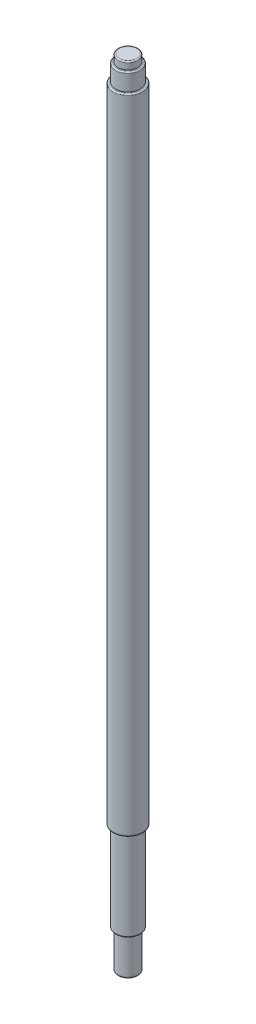
ISO-10303-21;
HEADER;
FILE_DESCRIPTION(('STEP AP214'),'2;1');
FILE_NAME('part.step','',(''),(''),'','','');
FILE_SCHEMA(('AUTOMOTIVE_DESIGN { 1 0 10303 214 1 1 1 1 }'));
ENDSEC;
DATA;
#1=APPLICATION_CONTEXT('core data for automotive mechanical design processes');
#2=APPLICATION_PROTOCOL_DEFINITION('international standard','automotive_design',2000,#1);
#3=PRODUCT_CONTEXT('',#1,'mechanical');
#4=PRODUCT('Part','Part','',(#3));
#5=PRODUCT_RELATED_PRODUCT_CATEGORY('part','',(#4));
#6=PRODUCT_DEFINITION_FORMATION('','',#4);
#7=PRODUCT_DEFINITION_CONTEXT('part definition',#1,'design');
#8=PRODUCT_DEFINITION('design','',#6,#7);
#9=PRODUCT_DEFINITION_SHAPE('','',#8);
#10=(LENGTH_UNIT() NAMED_UNIT(*) SI_UNIT(.MILLI.,.METRE.));
#11=(NAMED_UNIT(*) PLANE_ANGLE_UNIT() SI_UNIT($,.RADIAN.));
#12=(NAMED_UNIT(*) SI_UNIT($,.STERADIAN.) SOLID_ANGLE_UNIT());
#13=UNCERTAINTY_MEASURE_WITH_UNIT(LENGTH_MEASURE(1.E-05),#10,'distance_accuracy_value','');
#14=(GEOMETRIC_REPRESENTATION_CONTEXT(3) GLOBAL_UNCERTAINTY_ASSIGNED_CONTEXT((#13)) GLOBAL_UNIT_ASSIGNED_CONTEXT((#10,
#11,#12)) REPRESENTATION_CONTEXT('',''));
#15=CARTESIAN_POINT('',(0.,0.,0.));
#16=DIRECTION('',(0.,0.,1.));
#17=DIRECTION('',(1.,0.,0.));
#18=AXIS2_PLACEMENT_3D('',#15,#16,#17);
#19=CARTESIAN_POINT('',(0.,0.5,0.));
#20=DIRECTION('',(0.,1.,0.));
#21=DIRECTION('',(0.,0.,1.));
#22=AXIS2_PLACEMENT_3D('',#19,#20,#21);
#23=TOROIDAL_SURFACE('',#22,3.5,0.5);
#24=CARTESIAN_POINT('',(0.,0.5,0.));
#25=DIRECTION('',(0.,1.,0.));
#26=DIRECTION('',(0.,0.,1.));
#27=AXIS2_PLACEMENT_3D('',#24,#25,#26);
#28=CIRCLE('',#27,4.);
#29=CARTESIAN_POINT('',(0.,0.5,4.));
#30=VERTEX_POINT('',#29);
#31=EDGE_CURVE('E43',#30,#30,#28,.T.);
#32=ORIENTED_EDGE('',*,*,#31,.F.);
#33=EDGE_LOOP('',(#32));
#34=FACE_BOUND('',#33,.T.);
#35=CARTESIAN_POINT('',(0.,0.,0.));
#36=DIRECTION('',(0.,1.,0.));
#37=DIRECTION('',(0.,0.,1.));
#38=AXIS2_PLACEMENT_3D('',#35,#36,#37);
#39=CIRCLE('',#38,3.5);
#40=CARTESIAN_POINT('',(0.,0.,3.5));
#41=VERTEX_POINT('',#40);
#42=EDGE_CURVE('E10',#41,#41,#39,.F.);
#43=ORIENTED_EDGE('',*,*,#42,.F.);
#44=EDGE_LOOP('',(#43));
#45=FACE_BOUND('',#44,.T.);
#46=ADVANCED_FACE('F37',(#34,#45),#23,.T.);
#47=CARTESIAN_POINT('',(0.,15.5,0.));
#48=DIRECTION('',(0.,1.,0.));
#49=DIRECTION('',(0.,0.,1.));
#50=AXIS2_PLACEMENT_3D('',#47,#48,#49);
#51=TOROIDAL_SURFACE('',#50,4.5,0.5);
#52=CARTESIAN_POINT('',(0.,15.5,0.));
#53=DIRECTION('',(0.,1.,0.));
#54=DIRECTION('',(0.,0.,1.));
#55=AXIS2_PLACEMENT_3D('',#52,#53,#54);
#56=CIRCLE('',#55,5.);
#57=CARTESIAN_POINT('',(0.,15.5,5.));
#58=VERTEX_POINT('',#57);
#59=EDGE_CURVE('E51',#58,#58,#56,.T.);
#60=ORIENTED_EDGE('',*,*,#59,.F.);
#61=EDGE_LOOP('',(#60));
#62=FACE_BOUND('',#61,.T.);
#63=CARTESIAN_POINT('',(0.,15.,0.));
#64=DIRECTION('',(0.,1.,0.));
#65=DIRECTION('',(0.,0.,1.));
#66=AXIS2_PLACEMENT_3D('',#63,#64,#65);
#67=CIRCLE('',#66,4.5);
#68=CARTESIAN_POINT('',(0.,15.,4.5));
#69=VERTEX_POINT('',#68);
#70=EDGE_CURVE('E47',#69,#69,#67,.F.);
#71=ORIENTED_EDGE('',*,*,#70,.F.);
#72=EDGE_LOOP('',(#71));
#73=FACE_BOUND('',#72,.T.);
#74=ADVANCED_FACE('F111',(#62,#73),#51,.T.);
#75=CARTESIAN_POINT('',(0.,51.5,0.));
#76=DIRECTION('',(0.,1.,0.));
#77=DIRECTION('',(0.,0.,1.));
#78=AXIS2_PLACEMENT_3D('',#75,#76,#77);
#79=TOROIDAL_SURFACE('',#78,5.5,0.5);
#80=CARTESIAN_POINT('',(0.,51.5,0.));
#81=DIRECTION('',(0.,1.,0.));
#82=DIRECTION('',(0.,0.,1.));
#83=AXIS2_PLACEMENT_3D('',#80,#81,#82);
#84=CIRCLE('',#83,6.);
#85=CARTESIAN_POINT('',(0.,51.5,6.));
#86=VERTEX_POINT('',#85);
#87=EDGE_CURVE('E59',#86,#86,#84,.T.);
#88=ORIENTED_EDGE('',*,*,#87,.F.);
#89=EDGE_LOOP('',(#88));
#90=FACE_BOUND('',#89,.T.);
#91=CARTESIAN_POINT('',(0.,51.,0.));
#92=DIRECTION('',(0.,1.,0.));
#93=DIRECTION('',(0.,0.,1.));
#94=AXIS2_PLACEMENT_3D('',#91,#92,#93);
#95=CIRCLE('',#94,5.5);
#96=CARTESIAN_POINT('',(0.,51.,5.5));
#97=VERTEX_POINT('',#96);
#98=EDGE_CURVE('E56',#97,#97,#95,.F.);
#99=ORIENTED_EDGE('',*,*,#98,.F.);
#100=EDGE_LOOP('',(#99));
#101=FACE_BOUND('',#100,.T.);
#102=ADVANCED_FACE('F116',(#90,#101),#79,.T.);
#103=CARTESIAN_POINT('',(0.,310.5,0.));
#104=DIRECTION('',(0.,1.,0.));
#105=DIRECTION('',(0.,0.,1.));
#106=AXIS2_PLACEMENT_3D('',#103,#104,#105);
#107=TOROIDAL_SURFACE('',#106,5.5,0.5);
#108=CARTESIAN_POINT('',(0.,310.5,0.));
#109=DIRECTION('',(0.,1.,0.));
#110=DIRECTION('',(0.,0.,1.));
#111=AXIS2_PLACEMENT_3D('',#108,#109,#110);
#112=CIRCLE('',#111,6.);
#113=CARTESIAN_POINT('',(0.,310.5,6.));
#114=VERTEX_POINT('',#113);
#115=EDGE_CURVE('E65',#114,#114,#112,.F.);
#116=ORIENTED_EDGE('',*,*,#115,.F.);
#117=EDGE_LOOP('',(#116));
#118=FACE_BOUND('',#117,.T.);
#119=CARTESIAN_POINT('',(0.,311.,0.));
#120=DIRECTION('',(0.,1.,0.));
#121=DIRECTION('',(0.,0.,1.));
#122=AXIS2_PLACEMENT_3D('',#119,#120,#121);
#123=CIRCLE('',#122,5.5);
#124=CARTESIAN_POINT('',(0.,311.,5.5));
#125=VERTEX_POINT('',#124);
#126=EDGE_CURVE('E62',#125,#125,#123,.T.);
#127=ORIENTED_EDGE('',*,*,#126,.F.);
#128=EDGE_LOOP('',(#127));
#129=FACE_BOUND('',#128,.T.);
#130=ADVANCED_FACE('F122',(#118,#129),#107,.T.);
#131=CARTESIAN_POINT('',(0.,317.5,0.));
#132=DIRECTION('',(0.,1.,0.));
#133=DIRECTION('',(0.,0.,1.));
#134=AXIS2_PLACEMENT_3D('',#131,#132,#133);
#135=TOROIDAL_SURFACE('',#134,4.5,0.5);
#136=CARTESIAN_POINT('',(0.,317.5,0.));
#137=DIRECTION('',(0.,1.,0.));
#138=DIRECTION('',(0.,0.,1.));
#139=AXIS2_PLACEMENT_3D('',#136,#137,#138);
#140=CIRCLE('',#139,5.);
#141=CARTESIAN_POINT('',(0.,317.5,5.));
#142=VERTEX_POINT('',#141);
#143=EDGE_CURVE('E71',#142,#142,#140,.F.);
#144=ORIENTED_EDGE('',*,*,#143,.F.);
#145=EDGE_LOOP('',(#144));
#146=FACE_BOUND('',#145,.T.);
#147=CARTESIAN_POINT('',(0.,318.,0.));
#148=DIRECTION('',(0.,1.,0.));
#149=DIRECTION('',(0.,0.,1.));
#150=AXIS2_PLACEMENT_3D('',#147,#148,#149);
#151=CIRCLE('',#150,4.5);
#152=CARTESIAN_POINT('',(0.,318.,4.5));
#153=VERTEX_POINT('',#152);
#154=EDGE_CURVE('E68',#153,#153,#151,.T.);
#155=ORIENTED_EDGE('',*,*,#154,.F.);
#156=EDGE_LOOP('',(#155));
#157=FACE_BOUND('',#156,.T.);
#158=ADVANCED_FACE('F130',(#146,#157),#135,.T.);
#159=CARTESIAN_POINT('',(0.,320.5,0.));
#160=DIRECTION('',(0.,1.,0.));
#161=DIRECTION('',(0.,0.,1.));
#162=AXIS2_PLACEMENT_3D('',#159,#160,#161);
#163=TOROIDAL_SURFACE('',#162,3.5,0.5);
#164=CARTESIAN_POINT('',(0.,321.,0.));
#165=DIRECTION('',(0.,1.,0.));
#166=DIRECTION('',(0.,0.,1.));
#167=AXIS2_PLACEMENT_3D('',#164,#165,#166);
#168=CIRCLE('',#167,3.5);
#169=CARTESIAN_POINT('',(0.,321.,3.5));
#170=VERTEX_POINT('',#169);
#171=EDGE_CURVE('E77',#170,#170,#168,.T.);
#172=ORIENTED_EDGE('',*,*,#171,.F.);
#173=EDGE_LOOP('',(#172));
#174=FACE_BOUND('',#173,.T.);
#175=CARTESIAN_POINT('',(0.,320.5,0.));
#176=DIRECTION('',(0.,1.,0.));
#177=DIRECTION('',(0.,0.,1.));
#178=AXIS2_PLACEMENT_3D('',#175,#176,#177);
#179=CIRCLE('',#178,4.);
#180=CARTESIAN_POINT('',(0.,320.5,4.));
#181=VERTEX_POINT('',#180);
#182=EDGE_CURVE('E74',#181,#181,#179,.F.);
#183=ORIENTED_EDGE('',*,*,#182,.F.);
#184=EDGE_LOOP('',(#183));
#185=FACE_BOUND('',#184,.T.);
#186=ADVANCED_FACE('F134',(#174,#185),#163,.T.);
#187=CARTESIAN_POINT('',(0.,15.,0.));
#188=DIRECTION('',(0.,-1.,0.));
#189=DIRECTION('',(0.,0.,-1.));
#190=AXIS2_PLACEMENT_3D('',#187,#188,#189);
#191=CYLINDRICAL_SURFACE('',#190,4.);
#192=ORIENTED_EDGE('',*,*,#31,.T.);
#193=EDGE_LOOP('',(#192));
#194=FACE_BOUND('',#193,.T.);
#195=CARTESIAN_POINT('',(0.,15.,0.));
#196=DIRECTION('',(0.,1.,0.));
#197=DIRECTION('',(0.,0.,1.));
#198=AXIS2_PLACEMENT_3D('',#195,#196,#197);
#199=CIRCLE('',#198,4.);
#200=CARTESIAN_POINT('',(0.,15.,4.));
#201=VERTEX_POINT('',#200);
#202=EDGE_CURVE('E81',#201,#201,#199,.T.);
#203=ORIENTED_EDGE('',*,*,#202,.F.);
#204=EDGE_LOOP('',(#203));
#205=FACE_BOUND('',#204,.T.);
#206=ADVANCED_FACE('F138',(#194,#205),#191,.T.);
#207=CARTESIAN_POINT('',(0.,0.,0.));
#208=DIRECTION('',(0.,1.,0.));
#209=DIRECTION('',(0.,0.,1.));
#210=AXIS2_PLACEMENT_3D('',#207,#208,#209);
#211=PLANE('',#210);
#212=ORIENTED_EDGE('',*,*,#42,.T.);
#213=EDGE_LOOP('',(#212));
#214=FACE_BOUND('',#213,.T.);
#215=ADVANCED_FACE('F142',(#214),#211,.F.);
#216=CARTESIAN_POINT('',(0.,51.,0.));
#217=DIRECTION('',(0.,-1.,0.));
#218=DIRECTION('',(0.,0.,-1.));
#219=AXIS2_PLACEMENT_3D('',#216,#217,#218);
#220=CYLINDRICAL_SURFACE('',#219,5.);
#221=ORIENTED_EDGE('',*,*,#59,.T.);
#222=EDGE_LOOP('',(#221));
#223=FACE_BOUND('',#222,.T.);
#224=CARTESIAN_POINT('',(0.,51.,0.));
#225=DIRECTION('',(0.,1.,0.));
#226=DIRECTION('',(0.,0.,1.));
#227=AXIS2_PLACEMENT_3D('',#224,#225,#226);
#228=CIRCLE('',#227,5.);
#229=CARTESIAN_POINT('',(0.,51.,5.));
#230=VERTEX_POINT('',#229);
#231=EDGE_CURVE('E85',#230,#230,#228,.T.);
#232=ORIENTED_EDGE('',*,*,#231,.F.);
#233=EDGE_LOOP('',(#232));
#234=FACE_BOUND('',#233,.T.);
#235=ADVANCED_FACE('F145',(#223,#234),#220,.T.);
#236=CARTESIAN_POINT('',(0.,15.,0.));
#237=DIRECTION('',(0.,1.,0.));
#238=DIRECTION('',(0.,0.,1.));
#239=AXIS2_PLACEMENT_3D('',#236,#237,#238);
#240=PLANE('',#239);
#241=ORIENTED_EDGE('',*,*,#70,.T.);
#242=EDGE_LOOP('',(#241));
#243=FACE_BOUND('',#242,.T.);
#244=ORIENTED_EDGE('',*,*,#202,.T.);
#245=EDGE_LOOP('',(#244));
#246=FACE_BOUND('',#245,.T.);
#247=ADVANCED_FACE('F148',(#243,#246),#240,.F.);
#248=CARTESIAN_POINT('',(0.,311.,0.));
#249=DIRECTION('',(0.,-1.,0.));
#250=DIRECTION('',(0.,0.,-1.));
#251=AXIS2_PLACEMENT_3D('',#248,#249,#250);
#252=CYLINDRICAL_SURFACE('',#251,6.);
#253=ORIENTED_EDGE('',*,*,#87,.T.);
#254=EDGE_LOOP('',(#253));
#255=FACE_BOUND('',#254,.T.);
#256=ORIENTED_EDGE('',*,*,#115,.T.);
#257=EDGE_LOOP('',(#256));
#258=FACE_BOUND('',#257,.T.);
#259=ADVANCED_FACE('F152',(#255,#258),#252,.T.);
#260=CARTESIAN_POINT('',(0.,311.,0.));
#261=DIRECTION('',(0.,1.,0.));
#262=DIRECTION('',(0.,0.,1.));
#263=AXIS2_PLACEMENT_3D('',#260,#261,#262);
#264=PLANE('',#263);
#265=ORIENTED_EDGE('',*,*,#126,.T.);
#266=EDGE_LOOP('',(#265));
#267=FACE_BOUND('',#266,.T.);
#268=CARTESIAN_POINT('',(0.,311.,0.));
#269=DIRECTION('',(0.,1.,0.));
#270=DIRECTION('',(0.,0.,1.));
#271=AXIS2_PLACEMENT_3D('',#268,#269,#270);
#272=CIRCLE('',#271,5.);
#273=CARTESIAN_POINT('',(0.,311.,5.));
#274=VERTEX_POINT('',#273);
#275=EDGE_CURVE('E84',#274,#274,#272,.T.);
#276=ORIENTED_EDGE('',*,*,#275,.F.);
#277=EDGE_LOOP('',(#276));
#278=FACE_BOUND('',#277,.T.);
#279=ADVANCED_FACE('F156',(#267,#278),#264,.T.);
#280=CARTESIAN_POINT('',(0.,51.,0.));
#281=DIRECTION('',(0.,1.,0.));
#282=DIRECTION('',(0.,0.,1.));
#283=AXIS2_PLACEMENT_3D('',#280,#281,#282);
#284=PLANE('',#283);
#285=ORIENTED_EDGE('',*,*,#98,.T.);
#286=EDGE_LOOP('',(#285));
#287=FACE_BOUND('',#286,.T.);
#288=ORIENTED_EDGE('',*,*,#231,.T.);
#289=EDGE_LOOP('',(#288));
#290=FACE_BOUND('',#289,.T.);
#291=ADVANCED_FACE('F107',(#287,#290),#284,.F.);
#292=CARTESIAN_POINT('',(0.,318.,0.));
#293=DIRECTION('',(0.,-1.,0.));
#294=DIRECTION('',(0.,0.,-1.));
#295=AXIS2_PLACEMENT_3D('',#292,#293,#294);
#296=CYLINDRICAL_SURFACE('',#295,5.);
#297=ORIENTED_EDGE('',*,*,#143,.T.);
#298=EDGE_LOOP('',(#297));
#299=FACE_BOUND('',#298,.T.);
#300=ORIENTED_EDGE('',*,*,#275,.T.);
#301=EDGE_LOOP('',(#300));
#302=FACE_BOUND('',#301,.T.);
#303=ADVANCED_FACE('F97',(#299,#302),#296,.T.);
#304=CARTESIAN_POINT('',(0.,318.,0.));
#305=DIRECTION('',(0.,1.,0.));
#306=DIRECTION('',(0.,0.,1.));
#307=AXIS2_PLACEMENT_3D('',#304,#305,#306);
#308=PLANE('',#307);
#309=ORIENTED_EDGE('',*,*,#154,.T.);
#310=EDGE_LOOP('',(#309));
#311=FACE_BOUND('',#310,.T.);
#312=CARTESIAN_POINT('',(0.,318.,0.));
#313=DIRECTION('',(0.,1.,0.));
#314=DIRECTION('',(0.,0.,1.));
#315=AXIS2_PLACEMENT_3D('',#312,#313,#314);
#316=CIRCLE('',#315,4.);
#317=CARTESIAN_POINT('',(0.,318.,4.));
#318=VERTEX_POINT('',#317);
#319=EDGE_CURVE('E80',#318,#318,#316,.T.);
#320=ORIENTED_EDGE('',*,*,#319,.F.);
#321=EDGE_LOOP('',(#320));
#322=FACE_BOUND('',#321,.T.);
#323=ADVANCED_FACE('F95',(#311,#322),#308,.T.);
#324=CARTESIAN_POINT('',(0.,321.,0.));
#325=DIRECTION('',(0.,-1.,0.));
#326=DIRECTION('',(0.,0.,-1.));
#327=AXIS2_PLACEMENT_3D('',#324,#325,#326);
#328=CYLINDRICAL_SURFACE('',#327,4.);
#329=ORIENTED_EDGE('',*,*,#182,.T.);
#330=EDGE_LOOP('',(#329));
#331=FACE_BOUND('',#330,.T.);
#332=ORIENTED_EDGE('',*,*,#319,.T.);
#333=EDGE_LOOP('',(#332));
#334=FACE_BOUND('',#333,.T.);
#335=ADVANCED_FACE('F93',(#331,#334),#328,.T.);
#336=CARTESIAN_POINT('',(0.,321.,0.));
#337=DIRECTION('',(0.,1.,0.));
#338=DIRECTION('',(0.,0.,1.));
#339=AXIS2_PLACEMENT_3D('',#336,#337,#338);
#340=PLANE('',#339);
#341=ORIENTED_EDGE('',*,*,#171,.T.);
#342=EDGE_LOOP('',(#341));
#343=FACE_BOUND('',#342,.T.);
#344=ADVANCED_FACE('F104',(#343),#340,.T.);
#345=CLOSED_SHELL('',(#46,#74,#102,#130,#158,#186,#206,#215,#235,#247,#259,#279,#291,#303,#323,
#335,#344));
#346=MANIFOLD_SOLID_BREP('B2',#345);
#347=ADVANCED_BREP_SHAPE_REPRESENTATION('',(#18,#346),#14);
#348=SHAPE_DEFINITION_REPRESENTATION(#9,#347);
ENDSEC;
END-ISO-10303-21;
